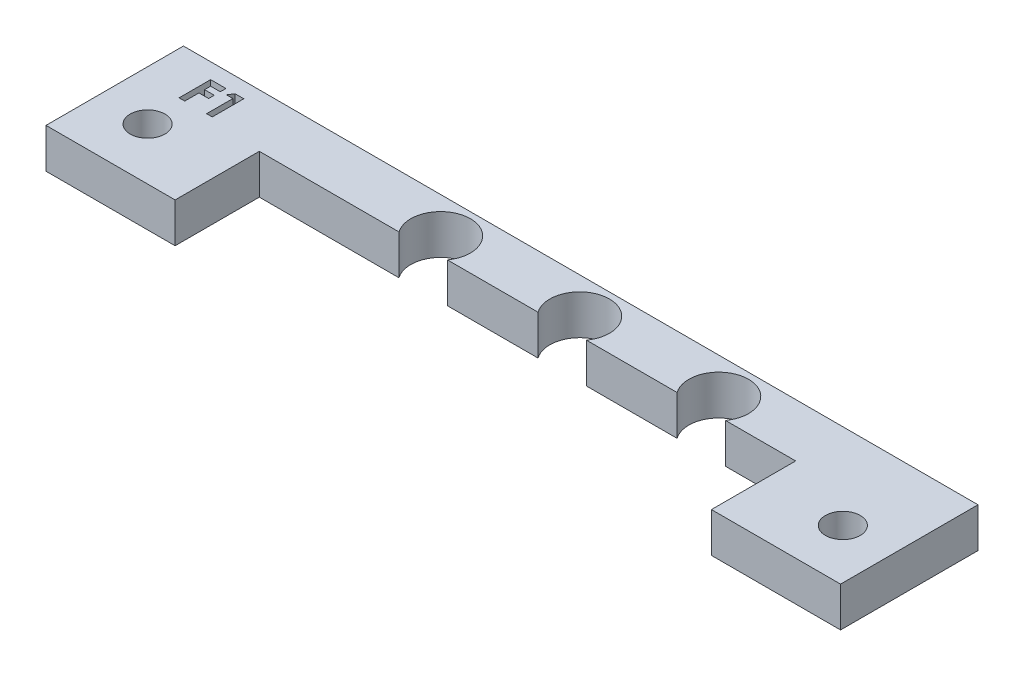
ISO-10303-21;
HEADER;
FILE_DESCRIPTION(('STEP AP214'),'2;1');
FILE_NAME('part.step','',(''),(''),'','','');
FILE_SCHEMA(('AUTOMOTIVE_DESIGN { 1 0 10303 214 1 1 1 1 }'));
ENDSEC;
DATA;
#1=APPLICATION_CONTEXT('core data for automotive mechanical design processes');
#2=APPLICATION_PROTOCOL_DEFINITION('international standard','automotive_design',2000,#1);
#3=PRODUCT_CONTEXT('',#1,'mechanical');
#4=PRODUCT('Part','Part','',(#3));
#5=PRODUCT_RELATED_PRODUCT_CATEGORY('part','',(#4));
#6=PRODUCT_DEFINITION_FORMATION('','',#4);
#7=PRODUCT_DEFINITION_CONTEXT('part definition',#1,'design');
#8=PRODUCT_DEFINITION('design','',#6,#7);
#9=PRODUCT_DEFINITION_SHAPE('','',#8);
#10=(LENGTH_UNIT() NAMED_UNIT(*) SI_UNIT(.MILLI.,.METRE.));
#11=(NAMED_UNIT(*) PLANE_ANGLE_UNIT() SI_UNIT($,.RADIAN.));
#12=(NAMED_UNIT(*) SI_UNIT($,.STERADIAN.) SOLID_ANGLE_UNIT());
#13=UNCERTAINTY_MEASURE_WITH_UNIT(LENGTH_MEASURE(1.E-05),#10,'distance_accuracy_value','');
#14=(GEOMETRIC_REPRESENTATION_CONTEXT(3) GLOBAL_UNCERTAINTY_ASSIGNED_CONTEXT((#13)) GLOBAL_UNIT_ASSIGNED_CONTEXT((#10,
#11,#12)) REPRESENTATION_CONTEXT('',''));
#15=CARTESIAN_POINT('',(0.,0.,0.));
#16=DIRECTION('',(0.,0.,1.));
#17=DIRECTION('',(1.,0.,0.));
#18=AXIS2_PLACEMENT_3D('',#15,#16,#17);
#19=CARTESIAN_POINT('',(0.,4.,0.));
#20=DIRECTION('',(0.,1.,0.));
#21=DIRECTION('',(0.,0.,1.));
#22=AXIS2_PLACEMENT_3D('',#19,#20,#21);
#23=PLANE('',#22);
#24=DIRECTION('',(0.,0.,1.));
#25=VECTOR('',#24,1.);
#26=CARTESIAN_POINT('',(60.3797761823175,4.,0.));
#27=LINE('',#26,#25);
#28=CARTESIAN_POINT('',(60.3797761823175,4.,4.97792171139692));
#29=VERTEX_POINT('',#28);
#30=CARTESIAN_POINT('',(60.3797761823175,4.,18.8163166195387));
#31=VERTEX_POINT('',#30);
#32=EDGE_CURVE('E339',#29,#31,#27,.T.);
#33=ORIENTED_EDGE('',*,*,#32,.F.);
#34=DIRECTION('',(1.,0.,0.));
#35=VECTOR('',#34,1.);
#36=CARTESIAN_POINT('',(0.,4.,4.97792171139692));
#37=LINE('',#36,#35);
#38=CARTESIAN_POINT('',(-19.6202238176825,4.,4.97792171139692));
#39=VERTEX_POINT('',#38);
#40=EDGE_CURVE('E343',#39,#29,#37,.T.);
#41=ORIENTED_EDGE('',*,*,#40,.F.);
#42=DIRECTION('',(0.,0.,-1.));
#43=VECTOR('',#42,1.);
#44=CARTESIAN_POINT('',(-19.6202238176825,4.,0.));
#45=LINE('',#44,#43);
#46=CARTESIAN_POINT('',(-19.6202238176825,4.,18.8163166195387));
#47=VERTEX_POINT('',#46);
#48=EDGE_CURVE('E348',#47,#39,#45,.T.);
#49=ORIENTED_EDGE('',*,*,#48,.F.);
#50=DIRECTION('',(1.,0.,0.));
#51=VECTOR('',#50,1.);
#52=CARTESIAN_POINT('',(0.,4.,18.8163166195387));
#53=LINE('',#52,#51);
#54=CARTESIAN_POINT('',(-6.62022381768248,4.,18.8163166195387));
#55=VERTEX_POINT('',#54);
#56=EDGE_CURVE('E352',#47,#55,#53,.T.);
#57=ORIENTED_EDGE('',*,*,#56,.T.);
#58=DIRECTION('',(0.,0.,1.));
#59=VECTOR('',#58,1.);
#60=CARTESIAN_POINT('',(-6.62022381768261,4.,0.));
#61=LINE('',#60,#59);
#62=CARTESIAN_POINT('',(-6.62022381768254,4.,10.3374425396581));
#63=VERTEX_POINT('',#62);
#64=EDGE_CURVE('E355',#63,#55,#61,.T.);
#65=ORIENTED_EDGE('',*,*,#64,.F.);
#66=DIRECTION('',(1.,0.,0.));
#67=VECTOR('',#66,1.);
#68=CARTESIAN_POINT('',(0.,4.,10.3374425396581));
#69=LINE('',#68,#67);
#70=CARTESIAN_POINT('',(7.44307774961269,4.,10.3374425396581));
#71=VERTEX_POINT('',#70);
#72=EDGE_CURVE('E359',#63,#71,#69,.T.);
#73=ORIENTED_EDGE('',*,*,#72,.T.);
#74=CARTESIAN_POINT('',(9.8797761823172,4.,8.58744232592798));
#75=DIRECTION('',(0.,1.,0.));
#76=DIRECTION('',(0.,0.,1.));
#77=AXIS2_PLACEMENT_3D('',#74,#75,#76);
#78=CIRCLE('',#77,3.);
#79=CARTESIAN_POINT('',(12.3164746150217,4.,10.3374425396581));
#80=VERTEX_POINT('',#79);
#81=EDGE_CURVE('E362',#80,#71,#78,.T.);
#82=ORIENTED_EDGE('',*,*,#81,.F.);
#83=DIRECTION('',(1.,0.,0.));
#84=VECTOR('',#83,1.);
#85=CARTESIAN_POINT('',(0.,4.,10.3374425396581));
#86=LINE('',#85,#84);
#87=CARTESIAN_POINT('',(21.4430777496133,4.,10.3374425396581));
#88=VERTEX_POINT('',#87);
#89=EDGE_CURVE('E366',#80,#88,#86,.T.);
#90=ORIENTED_EDGE('',*,*,#89,.T.);
#91=CARTESIAN_POINT('',(23.8797761823178,4.,8.58744232592798));
#92=DIRECTION('',(0.,1.,0.));
#93=DIRECTION('',(0.,0.,1.));
#94=AXIS2_PLACEMENT_3D('',#91,#92,#93);
#95=CIRCLE('',#94,3.);
#96=CARTESIAN_POINT('',(26.3164746150223,4.,10.3374425396581));
#97=VERTEX_POINT('',#96);
#98=EDGE_CURVE('E369',#97,#88,#95,.T.);
#99=ORIENTED_EDGE('',*,*,#98,.F.);
#100=DIRECTION('',(1.,0.,0.));
#101=VECTOR('',#100,1.);
#102=CARTESIAN_POINT('',(0.,4.,10.3374425396581));
#103=LINE('',#102,#101);
#104=CARTESIAN_POINT('',(35.4430777496131,4.,10.3374425396581));
#105=VERTEX_POINT('',#104);
#106=EDGE_CURVE('E373',#97,#105,#103,.T.);
#107=ORIENTED_EDGE('',*,*,#106,.T.);
#108=CARTESIAN_POINT('',(37.8797761823176,4.,8.58744232592797));
#109=DIRECTION('',(0.,1.,0.));
#110=DIRECTION('',(0.,0.,1.));
#111=AXIS2_PLACEMENT_3D('',#108,#109,#110);
#112=CIRCLE('',#111,3.);
#113=CARTESIAN_POINT('',(40.3164746150221,4.,10.3374425396581));
#114=VERTEX_POINT('',#113);
#115=EDGE_CURVE('E376',#114,#105,#112,.T.);
#116=ORIENTED_EDGE('',*,*,#115,.F.);
#117=DIRECTION('',(1.,0.,0.));
#118=VECTOR('',#117,1.);
#119=CARTESIAN_POINT('',(0.,4.,10.3374425396581));
#120=LINE('',#119,#118);
#121=CARTESIAN_POINT('',(47.3797761823176,4.,10.3374425396581));
#122=VERTEX_POINT('',#121);
#123=EDGE_CURVE('E380',#114,#122,#120,.T.);
#124=ORIENTED_EDGE('',*,*,#123,.T.);
#125=DIRECTION('',(0.,0.,-1.));
#126=VECTOR('',#125,1.);
#127=CARTESIAN_POINT('',(47.3797761823176,4.,0.));
#128=LINE('',#127,#126);
#129=CARTESIAN_POINT('',(47.3797761823175,4.,18.8163166195387));
#130=VERTEX_POINT('',#129);
#131=EDGE_CURVE('E383',#130,#122,#128,.T.);
#132=ORIENTED_EDGE('',*,*,#131,.F.);
#133=DIRECTION('',(1.,0.,0.));
#134=VECTOR('',#133,1.);
#135=CARTESIAN_POINT('',(0.,4.,18.8163166195387));
#136=LINE('',#135,#134);
#137=EDGE_CURVE('E387',#130,#31,#136,.T.);
#138=ORIENTED_EDGE('',*,*,#137,.T.);
#139=EDGE_LOOP('',(#33,#41,#49,#57,#65,#73,#82,#90,#99,#107,#116,#124,#132,#138));
#140=FACE_BOUND('',#139,.T.);
#141=CARTESIAN_POINT('',(-14.6202238176825,4.,13.5874425498356));
#142=DIRECTION('',(0.,1.,0.));
#143=DIRECTION('',(0.,0.,1.));
#144=AXIS2_PLACEMENT_3D('',#141,#142,#143);
#145=CIRCLE('',#144,1.75);
#146=CARTESIAN_POINT('',(-14.6202238176825,4.,15.3374425498356));
#147=VERTEX_POINT('',#146);
#148=EDGE_CURVE('E390',#147,#147,#145,.T.);
#149=ORIENTED_EDGE('',*,*,#148,.F.);
#150=EDGE_LOOP('',(#149));
#151=FACE_BOUND('',#150,.T.);
#152=CARTESIAN_POINT('',(55.3797761823175,4.,13.5874425498356));
#153=DIRECTION('',(0.,1.,0.));
#154=DIRECTION('',(0.,0.,1.));
#155=AXIS2_PLACEMENT_3D('',#152,#153,#154);
#156=CIRCLE('',#155,1.75);
#157=CARTESIAN_POINT('',(55.3797761823175,4.,15.3374425498356));
#158=VERTEX_POINT('',#157);
#159=EDGE_CURVE('E394',#158,#158,#156,.T.);
#160=ORIENTED_EDGE('',*,*,#159,.F.);
#161=EDGE_LOOP('',(#160));
#162=FACE_BOUND('',#161,.T.);
#163=DIRECTION('',(-1.,0.,0.));
#164=VECTOR('',#163,1.);
#165=CARTESIAN_POINT('',(-12.5528035614162,4.,7.06882575029212));
#166=LINE('',#165,#164);
#167=CARTESIAN_POINT('',(-12.5528035614162,4.,7.06882575029212));
#168=VERTEX_POINT('',#167);
#169=CARTESIAN_POINT('',(-13.2040856126982,4.,7.06882575029212));
#170=VERTEX_POINT('',#169);
#171=EDGE_CURVE('E299',#168,#170,#166,.T.);
#172=ORIENTED_EDGE('',*,*,#171,.T.);
#173=DIRECTION('',(0.54085977750342,0.,-0.841112775481951));
#174=VECTOR('',#173,1.);
#175=CARTESIAN_POINT('',(-13.2040856126982,4.,7.06882575029212));
#176=LINE('',#175,#174);
#177=CARTESIAN_POINT('',(-12.8638161816085,4.,6.53965908362545));
#178=VERTEX_POINT('',#177);
#179=EDGE_CURVE('E69',#170,#178,#176,.T.);
#180=ORIENTED_EDGE('',*,*,#179,.T.);
#181=DIRECTION('',(1.,0.,0.));
#182=VECTOR('',#181,1.);
#183=CARTESIAN_POINT('',(-12.8638161816085,4.,6.53965908362545));
#184=LINE('',#183,#182);
#185=CARTESIAN_POINT('',(-11.9829317665444,4.,6.53965908362545));
#186=VERTEX_POINT('',#185);
#187=EDGE_CURVE('E316',#178,#186,#184,.T.);
#188=ORIENTED_EDGE('',*,*,#187,.T.);
#189=DIRECTION('',(0.,0.,1.));
#190=VECTOR('',#189,1.);
#191=CARTESIAN_POINT('',(-11.9829317665444,4.,6.53965908362545));
#192=LINE('',#191,#190);
#193=CARTESIAN_POINT('',(-11.9829317665444,4.,9.71465908362545));
#194=VERTEX_POINT('',#193);
#195=EDGE_CURVE('E312',#186,#194,#192,.T.);
#196=ORIENTED_EDGE('',*,*,#195,.T.);
#197=DIRECTION('',(-1.,0.,0.));
#198=VECTOR('',#197,1.);
#199=CARTESIAN_POINT('',(-11.9829317665444,4.,9.71465908362545));
#200=LINE('',#199,#198);
#201=CARTESIAN_POINT('',(-12.5528035614162,4.,9.71465908362545));
#202=VERTEX_POINT('',#201);
#203=EDGE_CURVE('E308',#194,#202,#200,.T.);
#204=ORIENTED_EDGE('',*,*,#203,.T.);
#205=DIRECTION('',(0.,0.,-1.));
#206=VECTOR('',#205,1.);
#207=CARTESIAN_POINT('',(-12.5528035614162,4.,9.71465908362545));
#208=LINE('',#207,#206);
#209=EDGE_CURVE('E303',#202,#168,#208,.T.);
#210=ORIENTED_EDGE('',*,*,#209,.T.);
#211=EDGE_LOOP('',(#172,#180,#188,#196,#204,#210));
#212=FACE_BOUND('',#211,.T.);
#213=DIRECTION('',(-1.,0.,0.));
#214=VECTOR('',#213,1.);
#215=CARTESIAN_POINT('',(-14.7508804844931,4.,9.71465908362545));
#216=LINE('',#215,#214);
#217=CARTESIAN_POINT('',(-14.7508804844931,4.,9.71465908362545));
#218=VERTEX_POINT('',#217);
#219=CARTESIAN_POINT('',(-15.3207522793649,4.,9.71465908362545));
#220=VERTEX_POINT('',#219);
#221=EDGE_CURVE('E262',#218,#220,#216,.T.);
#222=ORIENTED_EDGE('',*,*,#221,.T.);
#223=DIRECTION('',(0.,0.,-1.));
#224=VECTOR('',#223,1.);
#225=CARTESIAN_POINT('',(-15.3207522793649,4.,9.71465908362545));
#226=LINE('',#225,#224);
#227=CARTESIAN_POINT('',(-15.3207522793649,4.,6.53965908362545));
#228=VERTEX_POINT('',#227);
#229=EDGE_CURVE('E61',#220,#228,#226,.T.);
#230=ORIENTED_EDGE('',*,*,#229,.T.);
#231=DIRECTION('',(1.,0.,0.));
#232=VECTOR('',#231,1.);
#233=CARTESIAN_POINT('',(-15.3207522793649,4.,6.53965908362545));
#234=LINE('',#233,#232);
#235=CARTESIAN_POINT('',(-13.77395740757,4.,6.53965908362545));
#236=VERTEX_POINT('',#235);
#237=EDGE_CURVE('E266',#228,#236,#234,.T.);
#238=ORIENTED_EDGE('',*,*,#237,.T.);
#239=DIRECTION('',(0.,0.,1.));
#240=VECTOR('',#239,1.);
#241=CARTESIAN_POINT('',(-13.77395740757,4.,6.53965908362545));
#242=LINE('',#241,#240);
#243=CARTESIAN_POINT('',(-13.77395740757,4.,7.10953087849725));
#244=VERTEX_POINT('',#243);
#245=EDGE_CURVE('E1118',#236,#244,#242,.T.);
#246=ORIENTED_EDGE('',*,*,#245,.T.);
#247=DIRECTION('',(-1.,0.,0.));
#248=VECTOR('',#247,1.);
#249=CARTESIAN_POINT('',(-13.77395740757,4.,7.10953087849725));
#250=LINE('',#249,#248);
#251=CARTESIAN_POINT('',(-14.7508804844931,4.,7.10953087849725));
#252=VERTEX_POINT('',#251);
#253=EDGE_CURVE('E1120',#244,#252,#250,.T.);
#254=ORIENTED_EDGE('',*,*,#253,.T.);
#255=DIRECTION('',(0.,0.,1.));
#256=VECTOR('',#255,1.);
#257=CARTESIAN_POINT('',(-14.7508804844931,4.,7.10953087849725));
#258=LINE('',#257,#256);
#259=CARTESIAN_POINT('',(-14.7508804844931,4.,7.72010780157417));
#260=VERTEX_POINT('',#259);
#261=EDGE_CURVE('E1125',#252,#260,#258,.T.);
#262=ORIENTED_EDGE('',*,*,#261,.T.);
#263=DIRECTION('',(1.,0.,0.));
#264=VECTOR('',#263,1.);
#265=CARTESIAN_POINT('',(-14.7508804844931,4.,7.72010780157417));
#266=LINE('',#265,#264);
#267=CARTESIAN_POINT('',(-13.77395740757,4.,7.72010780157417));
#268=VERTEX_POINT('',#267);
#269=EDGE_CURVE('E1135',#260,#268,#266,.T.);
#270=ORIENTED_EDGE('',*,*,#269,.T.);
#271=DIRECTION('',(0.,0.,1.));
#272=VECTOR('',#271,1.);
#273=CARTESIAN_POINT('',(-13.77395740757,4.,7.72010780157417));
#274=LINE('',#273,#272);
#275=CARTESIAN_POINT('',(-13.77395740757,4.,8.28997959644597));
#276=VERTEX_POINT('',#275);
#277=EDGE_CURVE('E1090',#268,#276,#274,.T.);
#278=ORIENTED_EDGE('',*,*,#277,.T.);
#279=DIRECTION('',(-1.,0.,0.));
#280=VECTOR('',#279,1.);
#281=CARTESIAN_POINT('',(-13.77395740757,4.,8.28997959644597));
#282=LINE('',#281,#280);
#283=CARTESIAN_POINT('',(-14.7508804844931,4.,8.28997959644597));
#284=VERTEX_POINT('',#283);
#285=EDGE_CURVE('E1085',#276,#284,#282,.T.);
#286=ORIENTED_EDGE('',*,*,#285,.T.);
#287=DIRECTION('',(0.,0.,1.));
#288=VECTOR('',#287,1.);
#289=CARTESIAN_POINT('',(-14.7508804844931,4.,8.28997959644597));
#290=LINE('',#289,#288);
#291=EDGE_CURVE('E1079',#284,#218,#290,.T.);
#292=ORIENTED_EDGE('',*,*,#291,.T.);
#293=EDGE_LOOP('',(#222,#230,#238,#246,#254,#262,#270,#278,#286,#292));
#294=FACE_BOUND('',#293,.T.);
#295=ADVANCED_FACE('F45',(#140,#151,#162,#212,#294),#23,.T.);
#296=CARTESIAN_POINT('',(60.3797761823175,4.,0.));
#297=DIRECTION('',(1.,0.,0.));
#298=DIRECTION('',(0.,0.,-1.));
#299=AXIS2_PLACEMENT_3D('',#296,#297,#298);
#300=PLANE('',#299);
#301=DIRECTION('',(0.,0.,1.));
#302=VECTOR('',#301,1.);
#303=CARTESIAN_POINT('',(60.3797761823175,0.,0.));
#304=LINE('',#303,#302);
#305=CARTESIAN_POINT('',(60.3797761823175,0.,4.97792171139692));
#306=VERTEX_POINT('',#305);
#307=CARTESIAN_POINT('',(60.3797761823175,0.,18.8163166195387));
#308=VERTEX_POINT('',#307);
#309=EDGE_CURVE('E268',#306,#308,#304,.T.);
#310=ORIENTED_EDGE('',*,*,#309,.F.);
#311=DIRECTION('',(0.,-1.,0.));
#312=VECTOR('',#311,1.);
#313=CARTESIAN_POINT('',(60.3797761823175,4.,4.97792171139692));
#314=LINE('',#313,#312);
#315=EDGE_CURVE('E11',#29,#306,#314,.T.);
#316=ORIENTED_EDGE('',*,*,#315,.F.);
#317=ORIENTED_EDGE('',*,*,#32,.T.);
#318=DIRECTION('',(0.,-1.,0.));
#319=VECTOR('',#318,1.);
#320=CARTESIAN_POINT('',(60.3797761823175,4.,18.8163166195387));
#321=LINE('',#320,#319);
#322=EDGE_CURVE('E397',#31,#308,#321,.T.);
#323=ORIENTED_EDGE('',*,*,#322,.T.);
#324=EDGE_LOOP('',(#310,#316,#317,#323));
#325=FACE_BOUND('',#324,.T.);
#326=ADVANCED_FACE('F47',(#325),#300,.T.);
#327=CARTESIAN_POINT('',(0.,4.,4.97792171139692));
#328=DIRECTION('',(0.,0.,-1.));
#329=DIRECTION('',(-1.,0.,0.));
#330=AXIS2_PLACEMENT_3D('',#327,#328,#329);
#331=PLANE('',#330);
#332=DIRECTION('',(1.,0.,0.));
#333=VECTOR('',#332,1.);
#334=CARTESIAN_POINT('',(0.,0.,4.97792171139692));
#335=LINE('',#334,#333);
#336=CARTESIAN_POINT('',(-19.6202238176825,0.,4.97792171139692));
#337=VERTEX_POINT('',#336);
#338=EDGE_CURVE('E274',#337,#306,#335,.T.);
#339=ORIENTED_EDGE('',*,*,#338,.F.);
#340=DIRECTION('',(0.,-1.,0.));
#341=VECTOR('',#340,1.);
#342=CARTESIAN_POINT('',(-19.6202238176825,4.,4.97792171139692));
#343=LINE('',#342,#341);
#344=EDGE_CURVE('E54',#39,#337,#343,.T.);
#345=ORIENTED_EDGE('',*,*,#344,.F.);
#346=ORIENTED_EDGE('',*,*,#40,.T.);
#347=ORIENTED_EDGE('',*,*,#315,.T.);
#348=EDGE_LOOP('',(#339,#345,#346,#347));
#349=FACE_BOUND('',#348,.T.);
#350=ADVANCED_FACE('F499',(#349),#331,.T.);
#351=CARTESIAN_POINT('',(-19.6202238176825,4.,0.));
#352=DIRECTION('',(-1.,0.,0.));
#353=DIRECTION('',(0.,0.,1.));
#354=AXIS2_PLACEMENT_3D('',#351,#352,#353);
#355=PLANE('',#354);
#356=DIRECTION('',(0.,0.,-1.));
#357=VECTOR('',#356,1.);
#358=CARTESIAN_POINT('',(-19.6202238176825,0.,0.));
#359=LINE('',#358,#357);
#360=CARTESIAN_POINT('',(-19.6202238176825,0.,18.8163166195387));
#361=VERTEX_POINT('',#360);
#362=EDGE_CURVE('E402',#361,#337,#359,.T.);
#363=ORIENTED_EDGE('',*,*,#362,.F.);
#364=DIRECTION('',(0.,-1.,0.));
#365=VECTOR('',#364,1.);
#366=CARTESIAN_POINT('',(-19.6202238176825,4.,18.8163166195387));
#367=LINE('',#366,#365);
#368=EDGE_CURVE('E489',#47,#361,#367,.T.);
#369=ORIENTED_EDGE('',*,*,#368,.F.);
#370=ORIENTED_EDGE('',*,*,#48,.T.);
#371=ORIENTED_EDGE('',*,*,#344,.T.);
#372=EDGE_LOOP('',(#363,#369,#370,#371));
#373=FACE_BOUND('',#372,.T.);
#374=ADVANCED_FACE('F495',(#373),#355,.T.);
#375=CARTESIAN_POINT('',(0.,4.,18.8163166195387));
#376=DIRECTION('',(0.,0.,-1.));
#377=DIRECTION('',(-1.,0.,0.));
#378=AXIS2_PLACEMENT_3D('',#375,#376,#377);
#379=PLANE('',#378);
#380=DIRECTION('',(1.,0.,0.));
#381=VECTOR('',#380,1.);
#382=CARTESIAN_POINT('',(0.,0.,18.8163166195387));
#383=LINE('',#382,#381);
#384=CARTESIAN_POINT('',(-6.62022381768248,0.,18.8163166195387));
#385=VERTEX_POINT('',#384);
#386=EDGE_CURVE('E406',#361,#385,#383,.T.);
#387=ORIENTED_EDGE('',*,*,#386,.T.);
#388=DIRECTION('',(0.,-1.,0.));
#389=VECTOR('',#388,1.);
#390=CARTESIAN_POINT('',(-6.62022381768248,4.,18.8163166195387));
#391=LINE('',#390,#389);
#392=EDGE_CURVE('E486',#55,#385,#391,.T.);
#393=ORIENTED_EDGE('',*,*,#392,.F.);
#394=ORIENTED_EDGE('',*,*,#56,.F.);
#395=ORIENTED_EDGE('',*,*,#368,.T.);
#396=EDGE_LOOP('',(#387,#393,#394,#395));
#397=FACE_BOUND('',#396,.T.);
#398=ADVANCED_FACE('F509',(#397),#379,.F.);
#399=CARTESIAN_POINT('',(-6.62022381768261,4.,0.));
#400=DIRECTION('',(1.,0.,0.));
#401=DIRECTION('',(0.,0.,-1.));
#402=AXIS2_PLACEMENT_3D('',#399,#400,#401);
#403=PLANE('',#402);
#404=DIRECTION('',(0.,0.,1.));
#405=VECTOR('',#404,1.);
#406=CARTESIAN_POINT('',(-6.62022381768261,0.,0.));
#407=LINE('',#406,#405);
#408=CARTESIAN_POINT('',(-6.62022381768254,0.,10.3374425396581));
#409=VERTEX_POINT('',#408);
#410=EDGE_CURVE('E410',#409,#385,#407,.T.);
#411=ORIENTED_EDGE('',*,*,#410,.F.);
#412=DIRECTION('',(0.,-1.,0.));
#413=VECTOR('',#412,1.);
#414=CARTESIAN_POINT('',(-6.62022381768254,4.,10.3374425396581));
#415=LINE('',#414,#413);
#416=EDGE_CURVE('E483',#63,#409,#415,.T.);
#417=ORIENTED_EDGE('',*,*,#416,.F.);
#418=ORIENTED_EDGE('',*,*,#64,.T.);
#419=ORIENTED_EDGE('',*,*,#392,.T.);
#420=EDGE_LOOP('',(#411,#417,#418,#419));
#421=FACE_BOUND('',#420,.T.);
#422=ADVANCED_FACE('F556',(#421),#403,.T.);
#423=CARTESIAN_POINT('',(0.,4.,10.3374425396581));
#424=DIRECTION('',(0.,0.,-1.));
#425=DIRECTION('',(-1.,0.,0.));
#426=AXIS2_PLACEMENT_3D('',#423,#424,#425);
#427=PLANE('',#426);
#428=DIRECTION('',(1.,0.,0.));
#429=VECTOR('',#428,1.);
#430=CARTESIAN_POINT('',(0.,0.,10.3374425396581));
#431=LINE('',#430,#429);
#432=CARTESIAN_POINT('',(7.44307774961269,0.,10.3374425396581));
#433=VERTEX_POINT('',#432);
#434=EDGE_CURVE('E414',#409,#433,#431,.T.);
#435=ORIENTED_EDGE('',*,*,#434,.T.);
#436=DIRECTION('',(0.,-1.,0.));
#437=VECTOR('',#436,1.);
#438=CARTESIAN_POINT('',(7.44307774961269,4.,10.3374425396581));
#439=LINE('',#438,#437);
#440=EDGE_CURVE('E480',#71,#433,#439,.T.);
#441=ORIENTED_EDGE('',*,*,#440,.F.);
#442=ORIENTED_EDGE('',*,*,#72,.F.);
#443=ORIENTED_EDGE('',*,*,#416,.T.);
#444=EDGE_LOOP('',(#435,#441,#442,#443));
#445=FACE_BOUND('',#444,.T.);
#446=ADVANCED_FACE('F554',(#445),#427,.F.);
#447=CARTESIAN_POINT('',(9.8797761823172,4.,8.58744232592798));
#448=DIRECTION('',(0.,-1.,0.));
#449=DIRECTION('',(0.,0.,-1.));
#450=AXIS2_PLACEMENT_3D('',#447,#448,#449);
#451=CYLINDRICAL_SURFACE('',#450,3.);
#452=CARTESIAN_POINT('',(9.8797761823172,0.,8.58744232592798));
#453=DIRECTION('',(0.,1.,0.));
#454=DIRECTION('',(0.,0.,1.));
#455=AXIS2_PLACEMENT_3D('',#452,#453,#454);
#456=CIRCLE('',#455,3.);
#457=CARTESIAN_POINT('',(12.3164746150217,0.,10.3374425396581));
#458=VERTEX_POINT('',#457);
#459=EDGE_CURVE('E418',#458,#433,#456,.T.);
#460=ORIENTED_EDGE('',*,*,#459,.F.);
#461=DIRECTION('',(0.,-1.,0.));
#462=VECTOR('',#461,1.);
#463=CARTESIAN_POINT('',(12.3164746150217,4.,10.3374425396581));
#464=LINE('',#463,#462);
#465=EDGE_CURVE('E477',#80,#458,#464,.T.);
#466=ORIENTED_EDGE('',*,*,#465,.F.);
#467=ORIENTED_EDGE('',*,*,#81,.T.);
#468=ORIENTED_EDGE('',*,*,#440,.T.);
#469=EDGE_LOOP('',(#460,#466,#467,#468));
#470=FACE_BOUND('',#469,.T.);
#471=ADVANCED_FACE('F549',(#470),#451,.F.);
#472=CARTESIAN_POINT('',(0.,4.,10.3374425396581));
#473=DIRECTION('',(0.,0.,-1.));
#474=DIRECTION('',(-1.,0.,0.));
#475=AXIS2_PLACEMENT_3D('',#472,#473,#474);
#476=PLANE('',#475);
#477=DIRECTION('',(1.,0.,0.));
#478=VECTOR('',#477,1.);
#479=CARTESIAN_POINT('',(0.,0.,10.3374425396581));
#480=LINE('',#479,#478);
#481=CARTESIAN_POINT('',(21.4430777496133,0.,10.3374425396581));
#482=VERTEX_POINT('',#481);
#483=EDGE_CURVE('E422',#458,#482,#480,.T.);
#484=ORIENTED_EDGE('',*,*,#483,.T.);
#485=DIRECTION('',(0.,-1.,0.));
#486=VECTOR('',#485,1.);
#487=CARTESIAN_POINT('',(21.4430777496133,4.,10.3374425396581));
#488=LINE('',#487,#486);
#489=EDGE_CURVE('E474',#88,#482,#488,.T.);
#490=ORIENTED_EDGE('',*,*,#489,.F.);
#491=ORIENTED_EDGE('',*,*,#89,.F.);
#492=ORIENTED_EDGE('',*,*,#465,.T.);
#493=EDGE_LOOP('',(#484,#490,#491,#492));
#494=FACE_BOUND('',#493,.T.);
#495=ADVANCED_FACE('F546',(#494),#476,.F.);
#496=CARTESIAN_POINT('',(23.8797761823178,4.,8.58744232592798));
#497=DIRECTION('',(0.,-1.,0.));
#498=DIRECTION('',(0.,0.,-1.));
#499=AXIS2_PLACEMENT_3D('',#496,#497,#498);
#500=CYLINDRICAL_SURFACE('',#499,3.);
#501=CARTESIAN_POINT('',(23.8797761823178,0.,8.58744232592798));
#502=DIRECTION('',(0.,1.,0.));
#503=DIRECTION('',(0.,0.,1.));
#504=AXIS2_PLACEMENT_3D('',#501,#502,#503);
#505=CIRCLE('',#504,3.);
#506=CARTESIAN_POINT('',(26.3164746150223,0.,10.3374425396581));
#507=VERTEX_POINT('',#506);
#508=EDGE_CURVE('E426',#507,#482,#505,.T.);
#509=ORIENTED_EDGE('',*,*,#508,.F.);
#510=DIRECTION('',(0.,-1.,0.));
#511=VECTOR('',#510,1.);
#512=CARTESIAN_POINT('',(26.3164746150223,4.,10.3374425396581));
#513=LINE('',#512,#511);
#514=EDGE_CURVE('E471',#97,#507,#513,.T.);
#515=ORIENTED_EDGE('',*,*,#514,.F.);
#516=ORIENTED_EDGE('',*,*,#98,.T.);
#517=ORIENTED_EDGE('',*,*,#489,.T.);
#518=EDGE_LOOP('',(#509,#515,#516,#517));
#519=FACE_BOUND('',#518,.T.);
#520=ADVANCED_FACE('F541',(#519),#500,.F.);
#521=CARTESIAN_POINT('',(0.,4.,10.3374425396581));
#522=DIRECTION('',(0.,0.,-1.));
#523=DIRECTION('',(-1.,0.,0.));
#524=AXIS2_PLACEMENT_3D('',#521,#522,#523);
#525=PLANE('',#524);
#526=DIRECTION('',(1.,0.,0.));
#527=VECTOR('',#526,1.);
#528=CARTESIAN_POINT('',(0.,0.,10.3374425396581));
#529=LINE('',#528,#527);
#530=CARTESIAN_POINT('',(35.4430777496131,0.,10.3374425396581));
#531=VERTEX_POINT('',#530);
#532=EDGE_CURVE('E430',#507,#531,#529,.T.);
#533=ORIENTED_EDGE('',*,*,#532,.T.);
#534=DIRECTION('',(0.,-1.,0.));
#535=VECTOR('',#534,1.);
#536=CARTESIAN_POINT('',(35.4430777496131,4.,10.3374425396581));
#537=LINE('',#536,#535);
#538=EDGE_CURVE('E468',#105,#531,#537,.T.);
#539=ORIENTED_EDGE('',*,*,#538,.F.);
#540=ORIENTED_EDGE('',*,*,#106,.F.);
#541=ORIENTED_EDGE('',*,*,#514,.T.);
#542=EDGE_LOOP('',(#533,#539,#540,#541));
#543=FACE_BOUND('',#542,.T.);
#544=ADVANCED_FACE('F537',(#543),#525,.F.);
#545=CARTESIAN_POINT('',(37.8797761823176,4.,8.58744232592797));
#546=DIRECTION('',(0.,-1.,0.));
#547=DIRECTION('',(0.,0.,-1.));
#548=AXIS2_PLACEMENT_3D('',#545,#546,#547);
#549=CYLINDRICAL_SURFACE('',#548,3.);
#550=CARTESIAN_POINT('',(37.8797761823176,0.,8.58744232592797));
#551=DIRECTION('',(0.,1.,0.));
#552=DIRECTION('',(0.,0.,1.));
#553=AXIS2_PLACEMENT_3D('',#550,#551,#552);
#554=CIRCLE('',#553,3.);
#555=CARTESIAN_POINT('',(40.3164746150221,0.,10.3374425396581));
#556=VERTEX_POINT('',#555);
#557=EDGE_CURVE('E434',#556,#531,#554,.T.);
#558=ORIENTED_EDGE('',*,*,#557,.F.);
#559=DIRECTION('',(0.,-1.,0.));
#560=VECTOR('',#559,1.);
#561=CARTESIAN_POINT('',(40.3164746150221,4.,10.3374425396581));
#562=LINE('',#561,#560);
#563=EDGE_CURVE('E465',#114,#556,#562,.T.);
#564=ORIENTED_EDGE('',*,*,#563,.F.);
#565=ORIENTED_EDGE('',*,*,#115,.T.);
#566=ORIENTED_EDGE('',*,*,#538,.T.);
#567=EDGE_LOOP('',(#558,#564,#565,#566));
#568=FACE_BOUND('',#567,.T.);
#569=ADVANCED_FACE('F532',(#568),#549,.F.);
#570=CARTESIAN_POINT('',(0.,4.,10.3374425396581));
#571=DIRECTION('',(0.,0.,-1.));
#572=DIRECTION('',(-1.,0.,0.));
#573=AXIS2_PLACEMENT_3D('',#570,#571,#572);
#574=PLANE('',#573);
#575=DIRECTION('',(1.,0.,0.));
#576=VECTOR('',#575,1.);
#577=CARTESIAN_POINT('',(0.,0.,10.3374425396581));
#578=LINE('',#577,#576);
#579=CARTESIAN_POINT('',(47.3797761823176,0.,10.3374425396581));
#580=VERTEX_POINT('',#579);
#581=EDGE_CURVE('E438',#556,#580,#578,.T.);
#582=ORIENTED_EDGE('',*,*,#581,.T.);
#583=DIRECTION('',(0.,-1.,0.));
#584=VECTOR('',#583,1.);
#585=CARTESIAN_POINT('',(47.3797761823176,4.,10.3374425396581));
#586=LINE('',#585,#584);
#587=EDGE_CURVE('E462',#122,#580,#586,.T.);
#588=ORIENTED_EDGE('',*,*,#587,.F.);
#589=ORIENTED_EDGE('',*,*,#123,.F.);
#590=ORIENTED_EDGE('',*,*,#563,.T.);
#591=EDGE_LOOP('',(#582,#588,#589,#590));
#592=FACE_BOUND('',#591,.T.);
#593=ADVANCED_FACE('F528',(#592),#574,.F.);
#594=CARTESIAN_POINT('',(47.3797761823176,4.,0.));
#595=DIRECTION('',(-1.,0.,0.));
#596=DIRECTION('',(0.,0.,1.));
#597=AXIS2_PLACEMENT_3D('',#594,#595,#596);
#598=PLANE('',#597);
#599=DIRECTION('',(0.,0.,-1.));
#600=VECTOR('',#599,1.);
#601=CARTESIAN_POINT('',(47.3797761823176,0.,0.));
#602=LINE('',#601,#600);
#603=CARTESIAN_POINT('',(47.3797761823175,0.,18.8163166195387));
#604=VERTEX_POINT('',#603);
#605=EDGE_CURVE('E442',#604,#580,#602,.T.);
#606=ORIENTED_EDGE('',*,*,#605,.F.);
#607=DIRECTION('',(0.,-1.,0.));
#608=VECTOR('',#607,1.);
#609=CARTESIAN_POINT('',(47.3797761823175,4.,18.8163166195387));
#610=LINE('',#609,#608);
#611=EDGE_CURVE('E459',#130,#604,#610,.T.);
#612=ORIENTED_EDGE('',*,*,#611,.F.);
#613=ORIENTED_EDGE('',*,*,#131,.T.);
#614=ORIENTED_EDGE('',*,*,#587,.T.);
#615=EDGE_LOOP('',(#606,#612,#613,#614));
#616=FACE_BOUND('',#615,.T.);
#617=ADVANCED_FACE('F524',(#616),#598,.T.);
#618=CARTESIAN_POINT('',(-14.6202238176825,4.,13.5874425498356));
#619=DIRECTION('',(0.,-1.,0.));
#620=DIRECTION('',(0.,0.,-1.));
#621=AXIS2_PLACEMENT_3D('',#618,#619,#620);
#622=CYLINDRICAL_SURFACE('',#621,1.75);
#623=ORIENTED_EDGE('',*,*,#148,.T.);
#624=EDGE_LOOP('',(#623));
#625=FACE_BOUND('',#624,.T.);
#626=CARTESIAN_POINT('',(-14.6202238176825,0.,13.5874425498356));
#627=DIRECTION('',(0.,1.,0.));
#628=DIRECTION('',(0.,0.,1.));
#629=AXIS2_PLACEMENT_3D('',#626,#627,#628);
#630=CIRCLE('',#629,1.75);
#631=CARTESIAN_POINT('',(-14.6202238176825,0.,15.3374425498356));
#632=VERTEX_POINT('',#631);
#633=EDGE_CURVE('E450',#632,#632,#630,.T.);
#634=ORIENTED_EDGE('',*,*,#633,.F.);
#635=EDGE_LOOP('',(#634));
#636=FACE_BOUND('',#635,.T.);
#637=ADVANCED_FACE('F582',(#625,#636),#622,.F.);
#638=CARTESIAN_POINT('',(0.,4.,18.8163166195387));
#639=DIRECTION('',(0.,0.,-1.));
#640=DIRECTION('',(-1.,0.,0.));
#641=AXIS2_PLACEMENT_3D('',#638,#639,#640);
#642=PLANE('',#641);
#643=DIRECTION('',(1.,0.,0.));
#644=VECTOR('',#643,1.);
#645=CARTESIAN_POINT('',(0.,0.,18.8163166195387));
#646=LINE('',#645,#644);
#647=EDGE_CURVE('E446',#604,#308,#646,.T.);
#648=ORIENTED_EDGE('',*,*,#647,.T.);
#649=ORIENTED_EDGE('',*,*,#322,.F.);
#650=ORIENTED_EDGE('',*,*,#137,.F.);
#651=ORIENTED_EDGE('',*,*,#611,.T.);
#652=EDGE_LOOP('',(#648,#649,#650,#651));
#653=FACE_BOUND('',#652,.T.);
#654=ADVANCED_FACE('F580',(#653),#642,.F.);
#655=CARTESIAN_POINT('',(55.3797761823175,4.,13.5874425498356));
#656=DIRECTION('',(0.,-1.,0.));
#657=DIRECTION('',(0.,0.,-1.));
#658=AXIS2_PLACEMENT_3D('',#655,#656,#657);
#659=CYLINDRICAL_SURFACE('',#658,1.75);
#660=ORIENTED_EDGE('',*,*,#159,.T.);
#661=EDGE_LOOP('',(#660));
#662=FACE_BOUND('',#661,.T.);
#663=CARTESIAN_POINT('',(55.3797761823175,0.,13.5874425498356));
#664=DIRECTION('',(0.,1.,0.));
#665=DIRECTION('',(0.,0.,1.));
#666=AXIS2_PLACEMENT_3D('',#663,#664,#665);
#667=CIRCLE('',#666,1.75);
#668=CARTESIAN_POINT('',(55.3797761823175,0.,15.3374425498356));
#669=VERTEX_POINT('',#668);
#670=EDGE_CURVE('E344',#669,#669,#667,.T.);
#671=ORIENTED_EDGE('',*,*,#670,.F.);
#672=EDGE_LOOP('',(#671));
#673=FACE_BOUND('',#672,.T.);
#674=ADVANCED_FACE('F577',(#662,#673),#659,.F.);
#675=CARTESIAN_POINT('',(0.,0.,0.));
#676=DIRECTION('',(0.,1.,0.));
#677=DIRECTION('',(0.,0.,1.));
#678=AXIS2_PLACEMENT_3D('',#675,#676,#677);
#679=PLANE('',#678);
#680=ORIENTED_EDGE('',*,*,#309,.T.);
#681=ORIENTED_EDGE('',*,*,#647,.F.);
#682=ORIENTED_EDGE('',*,*,#605,.T.);
#683=ORIENTED_EDGE('',*,*,#581,.F.);
#684=ORIENTED_EDGE('',*,*,#557,.T.);
#685=ORIENTED_EDGE('',*,*,#532,.F.);
#686=ORIENTED_EDGE('',*,*,#508,.T.);
#687=ORIENTED_EDGE('',*,*,#483,.F.);
#688=ORIENTED_EDGE('',*,*,#459,.T.);
#689=ORIENTED_EDGE('',*,*,#434,.F.);
#690=ORIENTED_EDGE('',*,*,#410,.T.);
#691=ORIENTED_EDGE('',*,*,#386,.F.);
#692=ORIENTED_EDGE('',*,*,#362,.T.);
#693=ORIENTED_EDGE('',*,*,#338,.T.);
#694=EDGE_LOOP('',(#680,#681,#682,#683,#684,#685,#686,#687,#688,#689,#690,#691,#692,#693));
#695=FACE_BOUND('',#694,.T.);
#696=ORIENTED_EDGE('',*,*,#633,.T.);
#697=EDGE_LOOP('',(#696));
#698=FACE_BOUND('',#697,.T.);
#699=ORIENTED_EDGE('',*,*,#670,.T.);
#700=EDGE_LOOP('',(#699));
#701=FACE_BOUND('',#700,.T.);
#702=ADVANCED_FACE('F503',(#695,#698,#701),#679,.F.);
#703=CARTESIAN_POINT('',(-13.2040856126982,3.,7.06882575029212));
#704=DIRECTION('',(0.841112775481951,0.,0.54085977750342));
#705=DIRECTION('',(0.54085977750342,0.,-0.841112775481951));
#706=AXIS2_PLACEMENT_3D('',#703,#704,#705);
#707=PLANE('',#706);
#708=ORIENTED_EDGE('',*,*,#179,.F.);
#709=DIRECTION('',(0.,1.,0.));
#710=VECTOR('',#709,1.);
#711=CARTESIAN_POINT('',(-13.2040856126982,3.,7.06882575029212));
#712=LINE('',#711,#710);
#713=CARTESIAN_POINT('',(-13.2040856126982,3.,7.06882575029212));
#714=VERTEX_POINT('',#713);
#715=EDGE_CURVE('E295',#714,#170,#712,.T.);
#716=ORIENTED_EDGE('',*,*,#715,.F.);
#717=DIRECTION('',(0.54085977750342,0.,-0.841112775481951));
#718=VECTOR('',#717,1.);
#719=CARTESIAN_POINT('',(-13.2040856126982,3.,7.06882575029212));
#720=LINE('',#719,#718);
#721=CARTESIAN_POINT('',(-12.8638161816085,3.,6.53965908362545));
#722=VERTEX_POINT('',#721);
#723=EDGE_CURVE('E304',#714,#722,#720,.T.);
#724=ORIENTED_EDGE('',*,*,#723,.T.);
#725=DIRECTION('',(0.,1.,0.));
#726=VECTOR('',#725,1.);
#727=CARTESIAN_POINT('',(-12.8638161816085,3.,6.53965908362545));
#728=LINE('',#727,#726);
#729=EDGE_CURVE('E280',#722,#178,#728,.T.);
#730=ORIENTED_EDGE('',*,*,#729,.T.);
#731=EDGE_LOOP('',(#708,#716,#724,#730));
#732=FACE_BOUND('',#731,.T.);
#733=ADVANCED_FACE('F576',(#732),#707,.T.);
#734=CARTESIAN_POINT('',(-12.8638161816085,3.,6.53965908362545));
#735=DIRECTION('',(0.,0.,1.));
#736=DIRECTION('',(1.,0.,0.));
#737=AXIS2_PLACEMENT_3D('',#734,#735,#736);
#738=PLANE('',#737);
#739=ORIENTED_EDGE('',*,*,#187,.F.);
#740=ORIENTED_EDGE('',*,*,#729,.F.);
#741=DIRECTION('',(1.,0.,0.));
#742=VECTOR('',#741,1.);
#743=CARTESIAN_POINT('',(-12.8638161816085,3.,6.53965908362545));
#744=LINE('',#743,#742);
#745=CARTESIAN_POINT('',(-11.9829317665444,3.,6.53965908362545));
#746=VERTEX_POINT('',#745);
#747=EDGE_CURVE('E333',#722,#746,#744,.T.);
#748=ORIENTED_EDGE('',*,*,#747,.T.);
#749=DIRECTION('',(0.,1.,0.));
#750=VECTOR('',#749,1.);
#751=CARTESIAN_POINT('',(-11.9829317665444,3.,6.53965908362545));
#752=LINE('',#751,#750);
#753=EDGE_CURVE('E283',#746,#186,#752,.T.);
#754=ORIENTED_EDGE('',*,*,#753,.T.);
#755=EDGE_LOOP('',(#739,#740,#748,#754));
#756=FACE_BOUND('',#755,.T.);
#757=ADVANCED_FACE('F651',(#756),#738,.T.);
#758=CARTESIAN_POINT('',(-11.9829317665444,3.,6.53965908362545));
#759=DIRECTION('',(-1.,0.,0.));
#760=DIRECTION('',(0.,0.,1.));
#761=AXIS2_PLACEMENT_3D('',#758,#759,#760);
#762=PLANE('',#761);
#763=ORIENTED_EDGE('',*,*,#195,.F.);
#764=ORIENTED_EDGE('',*,*,#753,.F.);
#765=DIRECTION('',(0.,0.,1.));
#766=VECTOR('',#765,1.);
#767=CARTESIAN_POINT('',(-11.9829317665444,3.,6.53965908362545));
#768=LINE('',#767,#766);
#769=CARTESIAN_POINT('',(-11.9829317665444,3.,9.71465908362545));
#770=VERTEX_POINT('',#769);
#771=EDGE_CURVE('E330',#746,#770,#768,.T.);
#772=ORIENTED_EDGE('',*,*,#771,.T.);
#773=DIRECTION('',(0.,1.,0.));
#774=VECTOR('',#773,1.);
#775=CARTESIAN_POINT('',(-11.9829317665444,3.,9.71465908362545));
#776=LINE('',#775,#774);
#777=EDGE_CURVE('E286',#770,#194,#776,.T.);
#778=ORIENTED_EDGE('',*,*,#777,.T.);
#779=EDGE_LOOP('',(#763,#764,#772,#778));
#780=FACE_BOUND('',#779,.T.);
#781=ADVANCED_FACE('F658',(#780),#762,.T.);
#782=CARTESIAN_POINT('',(-11.9829317665444,3.,9.71465908362545));
#783=DIRECTION('',(0.,0.,-1.));
#784=DIRECTION('',(-1.,0.,0.));
#785=AXIS2_PLACEMENT_3D('',#782,#783,#784);
#786=PLANE('',#785);
#787=ORIENTED_EDGE('',*,*,#203,.F.);
#788=ORIENTED_EDGE('',*,*,#777,.F.);
#789=DIRECTION('',(-1.,0.,0.));
#790=VECTOR('',#789,1.);
#791=CARTESIAN_POINT('',(-11.9829317665444,3.,9.71465908362545));
#792=LINE('',#791,#790);
#793=CARTESIAN_POINT('',(-12.5528035614162,3.,9.71465908362545));
#794=VERTEX_POINT('',#793);
#795=EDGE_CURVE('E327',#770,#794,#792,.T.);
#796=ORIENTED_EDGE('',*,*,#795,.T.);
#797=DIRECTION('',(0.,1.,0.));
#798=VECTOR('',#797,1.);
#799=CARTESIAN_POINT('',(-12.5528035614162,3.,9.71465908362545));
#800=LINE('',#799,#798);
#801=EDGE_CURVE('E289',#794,#202,#800,.T.);
#802=ORIENTED_EDGE('',*,*,#801,.T.);
#803=EDGE_LOOP('',(#787,#788,#796,#802));
#804=FACE_BOUND('',#803,.T.);
#805=ADVANCED_FACE('F666',(#804),#786,.T.);
#806=CARTESIAN_POINT('',(-12.5528035614162,3.,9.71465908362545));
#807=DIRECTION('',(1.,0.,0.));
#808=DIRECTION('',(0.,0.,-1.));
#809=AXIS2_PLACEMENT_3D('',#806,#807,#808);
#810=PLANE('',#809);
#811=ORIENTED_EDGE('',*,*,#209,.F.);
#812=ORIENTED_EDGE('',*,*,#801,.F.);
#813=DIRECTION('',(0.,0.,-1.));
#814=VECTOR('',#813,1.);
#815=CARTESIAN_POINT('',(-12.5528035614162,3.,9.71465908362545));
#816=LINE('',#815,#814);
#817=CARTESIAN_POINT('',(-12.5528035614162,3.,7.06882575029212));
#818=VERTEX_POINT('',#817);
#819=EDGE_CURVE('E324',#794,#818,#816,.T.);
#820=ORIENTED_EDGE('',*,*,#819,.T.);
#821=DIRECTION('',(0.,1.,0.));
#822=VECTOR('',#821,1.);
#823=CARTESIAN_POINT('',(-12.5528035614162,3.,7.06882575029212));
#824=LINE('',#823,#822);
#825=EDGE_CURVE('E292',#818,#168,#824,.T.);
#826=ORIENTED_EDGE('',*,*,#825,.T.);
#827=EDGE_LOOP('',(#811,#812,#820,#826));
#828=FACE_BOUND('',#827,.T.);
#829=ADVANCED_FACE('F674',(#828),#810,.T.);
#830=CARTESIAN_POINT('',(-12.5528035614162,3.,7.06882575029212));
#831=DIRECTION('',(0.,0.,-1.));
#832=DIRECTION('',(-1.,0.,0.));
#833=AXIS2_PLACEMENT_3D('',#830,#831,#832);
#834=PLANE('',#833);
#835=ORIENTED_EDGE('',*,*,#171,.F.);
#836=ORIENTED_EDGE('',*,*,#825,.F.);
#837=DIRECTION('',(-1.,0.,0.));
#838=VECTOR('',#837,1.);
#839=CARTESIAN_POINT('',(-12.5528035614162,3.,7.06882575029212));
#840=LINE('',#839,#838);
#841=EDGE_CURVE('E298',#818,#714,#840,.T.);
#842=ORIENTED_EDGE('',*,*,#841,.T.);
#843=ORIENTED_EDGE('',*,*,#715,.T.);
#844=EDGE_LOOP('',(#835,#836,#842,#843));
#845=FACE_BOUND('',#844,.T.);
#846=ADVANCED_FACE('F682',(#845),#834,.T.);
#847=CARTESIAN_POINT('',(0.,3.,0.));
#848=DIRECTION('',(0.,-1.,0.));
#849=DIRECTION('',(0.,0.,-1.));
#850=AXIS2_PLACEMENT_3D('',#847,#848,#849);
#851=PLANE('',#850);
#852=ORIENTED_EDGE('',*,*,#723,.F.);
#853=ORIENTED_EDGE('',*,*,#841,.F.);
#854=ORIENTED_EDGE('',*,*,#819,.F.);
#855=ORIENTED_EDGE('',*,*,#795,.F.);
#856=ORIENTED_EDGE('',*,*,#771,.F.);
#857=ORIENTED_EDGE('',*,*,#747,.F.);
#858=EDGE_LOOP('',(#852,#853,#854,#855,#856,#857));
#859=FACE_BOUND('',#858,.T.);
#860=ADVANCED_FACE('F572',(#859),#851,.F.);
#861=CARTESIAN_POINT('',(-15.3207522793649,3.,9.71465908362545));
#862=DIRECTION('',(1.,0.,0.));
#863=DIRECTION('',(0.,0.,-1.));
#864=AXIS2_PLACEMENT_3D('',#861,#862,#863);
#865=PLANE('',#864);
#866=ORIENTED_EDGE('',*,*,#229,.F.);
#867=DIRECTION('',(0.,1.,0.));
#868=VECTOR('',#867,1.);
#869=CARTESIAN_POINT('',(-15.3207522793649,3.,9.71465908362545));
#870=LINE('',#869,#868);
#871=CARTESIAN_POINT('',(-15.3207522793649,3.,9.71465908362545));
#872=VERTEX_POINT('',#871);
#873=EDGE_CURVE('E260',#872,#220,#870,.T.);
#874=ORIENTED_EDGE('',*,*,#873,.F.);
#875=DIRECTION('',(0.,0.,-1.));
#876=VECTOR('',#875,1.);
#877=CARTESIAN_POINT('',(-15.3207522793649,3.,9.71465908362545));
#878=LINE('',#877,#876);
#879=CARTESIAN_POINT('',(-15.3207522793649,3.,6.53965908362545));
#880=VERTEX_POINT('',#879);
#881=EDGE_CURVE('E250',#872,#880,#878,.T.);
#882=ORIENTED_EDGE('',*,*,#881,.T.);
#883=DIRECTION('',(0.,1.,0.));
#884=VECTOR('',#883,1.);
#885=CARTESIAN_POINT('',(-15.3207522793649,3.,6.53965908362545));
#886=LINE('',#885,#884);
#887=EDGE_CURVE('E259',#880,#228,#886,.T.);
#888=ORIENTED_EDGE('',*,*,#887,.T.);
#889=EDGE_LOOP('',(#866,#874,#882,#888));
#890=FACE_BOUND('',#889,.T.);
#891=ADVANCED_FACE('F258',(#890),#865,.T.);
#892=CARTESIAN_POINT('',(-15.3207522793649,3.,6.53965908362545));
#893=DIRECTION('',(0.,0.,1.));
#894=DIRECTION('',(1.,0.,0.));
#895=AXIS2_PLACEMENT_3D('',#892,#893,#894);
#896=PLANE('',#895);
#897=ORIENTED_EDGE('',*,*,#237,.F.);
#898=ORIENTED_EDGE('',*,*,#887,.F.);
#899=DIRECTION('',(1.,0.,0.));
#900=VECTOR('',#899,1.);
#901=CARTESIAN_POINT('',(-15.3207522793649,3.,6.53965908362545));
#902=LINE('',#901,#900);
#903=CARTESIAN_POINT('',(-13.77395740757,3.,6.53965908362545));
#904=VERTEX_POINT('',#903);
#905=EDGE_CURVE('E246',#880,#904,#902,.T.);
#906=ORIENTED_EDGE('',*,*,#905,.T.);
#907=DIRECTION('',(0.,1.,0.));
#908=VECTOR('',#907,1.);
#909=CARTESIAN_POINT('',(-13.77395740757,3.,6.53965908362545));
#910=LINE('',#909,#908);
#911=EDGE_CURVE('E269',#904,#236,#910,.T.);
#912=ORIENTED_EDGE('',*,*,#911,.T.);
#913=EDGE_LOOP('',(#897,#898,#906,#912));
#914=FACE_BOUND('',#913,.T.);
#915=ADVANCED_FACE('F264',(#914),#896,.T.);
#916=CARTESIAN_POINT('',(-13.77395740757,3.,6.53965908362545));
#917=DIRECTION('',(-1.,0.,0.));
#918=DIRECTION('',(0.,0.,1.));
#919=AXIS2_PLACEMENT_3D('',#916,#917,#918);
#920=PLANE('',#919);
#921=ORIENTED_EDGE('',*,*,#245,.F.);
#922=ORIENTED_EDGE('',*,*,#911,.F.);
#923=DIRECTION('',(0.,0.,1.));
#924=VECTOR('',#923,1.);
#925=CARTESIAN_POINT('',(-13.77395740757,3.,6.53965908362545));
#926=LINE('',#925,#924);
#927=CARTESIAN_POINT('',(-13.77395740757,3.,7.10953087849725));
#928=VERTEX_POINT('',#927);
#929=EDGE_CURVE('E252',#904,#928,#926,.T.);
#930=ORIENTED_EDGE('',*,*,#929,.T.);
#931=DIRECTION('',(0.,1.,0.));
#932=VECTOR('',#931,1.);
#933=CARTESIAN_POINT('',(-13.77395740757,3.,7.10953087849725));
#934=LINE('',#933,#932);
#935=EDGE_CURVE('E276',#928,#244,#934,.T.);
#936=ORIENTED_EDGE('',*,*,#935,.T.);
#937=EDGE_LOOP('',(#921,#922,#930,#936));
#938=FACE_BOUND('',#937,.T.);
#939=ADVANCED_FACE('F708',(#938),#920,.T.);
#940=CARTESIAN_POINT('',(-13.77395740757,3.,7.10953087849725));
#941=DIRECTION('',(0.,0.,-1.));
#942=DIRECTION('',(-1.,0.,0.));
#943=AXIS2_PLACEMENT_3D('',#940,#941,#942);
#944=PLANE('',#943);
#945=ORIENTED_EDGE('',*,*,#253,.F.);
#946=ORIENTED_EDGE('',*,*,#935,.F.);
#947=DIRECTION('',(-1.,0.,0.));
#948=VECTOR('',#947,1.);
#949=CARTESIAN_POINT('',(-13.77395740757,3.,7.10953087849725));
#950=LINE('',#949,#948);
#951=CARTESIAN_POINT('',(-14.7508804844931,3.,7.10953087849725));
#952=VERTEX_POINT('',#951);
#953=EDGE_CURVE('E1165',#928,#952,#950,.T.);
#954=ORIENTED_EDGE('',*,*,#953,.T.);
#955=DIRECTION('',(0.,1.,0.));
#956=VECTOR('',#955,1.);
#957=CARTESIAN_POINT('',(-14.7508804844931,3.,7.10953087849725));
#958=LINE('',#957,#956);
#959=EDGE_CURVE('E1111',#952,#252,#958,.T.);
#960=ORIENTED_EDGE('',*,*,#959,.T.);
#961=EDGE_LOOP('',(#945,#946,#954,#960));
#962=FACE_BOUND('',#961,.T.);
#963=ADVANCED_FACE('F715',(#962),#944,.T.);
#964=CARTESIAN_POINT('',(-14.7508804844931,3.,7.10953087849725));
#965=DIRECTION('',(-1.,0.,0.));
#966=DIRECTION('',(0.,0.,1.));
#967=AXIS2_PLACEMENT_3D('',#964,#965,#966);
#968=PLANE('',#967);
#969=ORIENTED_EDGE('',*,*,#261,.F.);
#970=ORIENTED_EDGE('',*,*,#959,.F.);
#971=DIRECTION('',(0.,0.,1.));
#972=VECTOR('',#971,1.);
#973=CARTESIAN_POINT('',(-14.7508804844931,3.,7.10953087849725));
#974=LINE('',#973,#972);
#975=CARTESIAN_POINT('',(-14.7508804844931,3.,7.72010780157417));
#976=VERTEX_POINT('',#975);
#977=EDGE_CURVE('E1162',#952,#976,#974,.T.);
#978=ORIENTED_EDGE('',*,*,#977,.T.);
#979=DIRECTION('',(0.,1.,0.));
#980=VECTOR('',#979,1.);
#981=CARTESIAN_POINT('',(-14.7508804844931,3.,7.72010780157417));
#982=LINE('',#981,#980);
#983=EDGE_CURVE('E1108',#976,#260,#982,.T.);
#984=ORIENTED_EDGE('',*,*,#983,.T.);
#985=EDGE_LOOP('',(#969,#970,#978,#984));
#986=FACE_BOUND('',#985,.T.);
#987=ADVANCED_FACE('F723',(#986),#968,.T.);
#988=CARTESIAN_POINT('',(-14.7508804844931,3.,7.72010780157417));
#989=DIRECTION('',(0.,0.,1.));
#990=DIRECTION('',(1.,0.,0.));
#991=AXIS2_PLACEMENT_3D('',#988,#989,#990);
#992=PLANE('',#991);
#993=ORIENTED_EDGE('',*,*,#269,.F.);
#994=ORIENTED_EDGE('',*,*,#983,.F.);
#995=DIRECTION('',(1.,0.,0.));
#996=VECTOR('',#995,1.);
#997=CARTESIAN_POINT('',(-14.7508804844931,3.,7.72010780157417));
#998=LINE('',#997,#996);
#999=CARTESIAN_POINT('',(-13.77395740757,3.,7.72010780157417));
#1000=VERTEX_POINT('',#999);
#1001=EDGE_CURVE('E1159',#976,#1000,#998,.T.);
#1002=ORIENTED_EDGE('',*,*,#1001,.T.);
#1003=DIRECTION('',(0.,1.,0.));
#1004=VECTOR('',#1003,1.);
#1005=CARTESIAN_POINT('',(-13.77395740757,3.,7.72010780157417));
#1006=LINE('',#1005,#1004);
#1007=EDGE_CURVE('E1105',#1000,#268,#1006,.T.);
#1008=ORIENTED_EDGE('',*,*,#1007,.T.);
#1009=EDGE_LOOP('',(#993,#994,#1002,#1008));
#1010=FACE_BOUND('',#1009,.T.);
#1011=ADVANCED_FACE('F731',(#1010),#992,.T.);
#1012=CARTESIAN_POINT('',(-13.77395740757,3.,7.72010780157417));
#1013=DIRECTION('',(-1.,0.,0.));
#1014=DIRECTION('',(0.,0.,1.));
#1015=AXIS2_PLACEMENT_3D('',#1012,#1013,#1014);
#1016=PLANE('',#1015);
#1017=ORIENTED_EDGE('',*,*,#277,.F.);
#1018=ORIENTED_EDGE('',*,*,#1007,.F.);
#1019=DIRECTION('',(0.,0.,1.));
#1020=VECTOR('',#1019,1.);
#1021=CARTESIAN_POINT('',(-13.77395740757,3.,7.72010780157417));
#1022=LINE('',#1021,#1020);
#1023=CARTESIAN_POINT('',(-13.77395740757,3.,8.28997959644597));
#1024=VERTEX_POINT('',#1023);
#1025=EDGE_CURVE('E1144',#1000,#1024,#1022,.T.);
#1026=ORIENTED_EDGE('',*,*,#1025,.T.);
#1027=DIRECTION('',(0.,1.,0.));
#1028=VECTOR('',#1027,1.);
#1029=CARTESIAN_POINT('',(-13.77395740757,3.,8.28997959644597));
#1030=LINE('',#1029,#1028);
#1031=EDGE_CURVE('E1102',#1024,#276,#1030,.T.);
#1032=ORIENTED_EDGE('',*,*,#1031,.T.);
#1033=EDGE_LOOP('',(#1017,#1018,#1026,#1032));
#1034=FACE_BOUND('',#1033,.T.);
#1035=ADVANCED_FACE('F739',(#1034),#1016,.T.);
#1036=CARTESIAN_POINT('',(-13.77395740757,3.,8.28997959644597));
#1037=DIRECTION('',(0.,0.,-1.));
#1038=DIRECTION('',(-1.,0.,0.));
#1039=AXIS2_PLACEMENT_3D('',#1036,#1037,#1038);
#1040=PLANE('',#1039);
#1041=ORIENTED_EDGE('',*,*,#285,.F.);
#1042=ORIENTED_EDGE('',*,*,#1031,.F.);
#1043=DIRECTION('',(-1.,0.,0.));
#1044=VECTOR('',#1043,1.);
#1045=CARTESIAN_POINT('',(-13.77395740757,3.,8.28997959644597));
#1046=LINE('',#1045,#1044);
#1047=CARTESIAN_POINT('',(-14.7508804844931,3.,8.28997959644597));
#1048=VERTEX_POINT('',#1047);
#1049=EDGE_CURVE('E1146',#1024,#1048,#1046,.T.);
#1050=ORIENTED_EDGE('',*,*,#1049,.T.);
#1051=DIRECTION('',(0.,1.,0.));
#1052=VECTOR('',#1051,1.);
#1053=CARTESIAN_POINT('',(-14.7508804844931,3.,8.28997959644597));
#1054=LINE('',#1053,#1052);
#1055=EDGE_CURVE('E1099',#1048,#284,#1054,.T.);
#1056=ORIENTED_EDGE('',*,*,#1055,.T.);
#1057=EDGE_LOOP('',(#1041,#1042,#1050,#1056));
#1058=FACE_BOUND('',#1057,.T.);
#1059=ADVANCED_FACE('F747',(#1058),#1040,.T.);
#1060=CARTESIAN_POINT('',(-14.7508804844931,3.,8.28997959644597));
#1061=DIRECTION('',(-1.,0.,0.));
#1062=DIRECTION('',(0.,0.,1.));
#1063=AXIS2_PLACEMENT_3D('',#1060,#1061,#1062);
#1064=PLANE('',#1063);
#1065=ORIENTED_EDGE('',*,*,#291,.F.);
#1066=ORIENTED_EDGE('',*,*,#1055,.F.);
#1067=DIRECTION('',(0.,0.,1.));
#1068=VECTOR('',#1067,1.);
#1069=CARTESIAN_POINT('',(-14.7508804844931,3.,8.28997959644597));
#1070=LINE('',#1069,#1068);
#1071=CARTESIAN_POINT('',(-14.7508804844931,3.,9.71465908362545));
#1072=VERTEX_POINT('',#1071);
#1073=EDGE_CURVE('E1148',#1048,#1072,#1070,.T.);
#1074=ORIENTED_EDGE('',*,*,#1073,.T.);
#1075=DIRECTION('',(0.,1.,0.));
#1076=VECTOR('',#1075,1.);
#1077=CARTESIAN_POINT('',(-14.7508804844931,3.,9.71465908362545));
#1078=LINE('',#1077,#1076);
#1079=EDGE_CURVE('E1076',#1072,#218,#1078,.T.);
#1080=ORIENTED_EDGE('',*,*,#1079,.T.);
#1081=EDGE_LOOP('',(#1065,#1066,#1074,#1080));
#1082=FACE_BOUND('',#1081,.T.);
#1083=ADVANCED_FACE('F755',(#1082),#1064,.T.);
#1084=CARTESIAN_POINT('',(-14.7508804844931,3.,9.71465908362545));
#1085=DIRECTION('',(0.,0.,-1.));
#1086=DIRECTION('',(-1.,0.,0.));
#1087=AXIS2_PLACEMENT_3D('',#1084,#1085,#1086);
#1088=PLANE('',#1087);
#1089=ORIENTED_EDGE('',*,*,#221,.F.);
#1090=ORIENTED_EDGE('',*,*,#1079,.F.);
#1091=DIRECTION('',(-1.,0.,0.));
#1092=VECTOR('',#1091,1.);
#1093=CARTESIAN_POINT('',(-14.7508804844931,3.,9.71465908362545));
#1094=LINE('',#1093,#1092);
#1095=EDGE_CURVE('E1096',#1072,#872,#1094,.T.);
#1096=ORIENTED_EDGE('',*,*,#1095,.T.);
#1097=ORIENTED_EDGE('',*,*,#873,.T.);
#1098=EDGE_LOOP('',(#1089,#1090,#1096,#1097));
#1099=FACE_BOUND('',#1098,.T.);
#1100=ADVANCED_FACE('F763',(#1099),#1088,.T.);
#1101=CARTESIAN_POINT('',(0.,3.,0.));
#1102=DIRECTION('',(0.,-1.,0.));
#1103=DIRECTION('',(0.,0.,-1.));
#1104=AXIS2_PLACEMENT_3D('',#1101,#1102,#1103);
#1105=PLANE('',#1104);
#1106=ORIENTED_EDGE('',*,*,#881,.F.);
#1107=ORIENTED_EDGE('',*,*,#1095,.F.);
#1108=ORIENTED_EDGE('',*,*,#1073,.F.);
#1109=ORIENTED_EDGE('',*,*,#1049,.F.);
#1110=ORIENTED_EDGE('',*,*,#1025,.F.);
#1111=ORIENTED_EDGE('',*,*,#1001,.F.);
#1112=ORIENTED_EDGE('',*,*,#977,.F.);
#1113=ORIENTED_EDGE('',*,*,#953,.F.);
#1114=ORIENTED_EDGE('',*,*,#929,.F.);
#1115=ORIENTED_EDGE('',*,*,#905,.F.);
#1116=EDGE_LOOP('',(#1106,#1107,#1108,#1109,#1110,#1111,#1112,#1113,#1114,#1115));
#1117=FACE_BOUND('',#1116,.T.);
#1118=ADVANCED_FACE('F248',(#1117),#1105,.F.);
#1119=CLOSED_SHELL('',(#295,#326,#350,#374,#398,#422,#446,#471,#495,#520,#544,#569,#593,#617,
#637,#654,#674,#702,#733,#757,#781,#805,#829,#846,#860,#891,#915,#939,#963,#987,#1011,#1035,
#1059,#1083,#1100,#1118));
#1120=MANIFOLD_SOLID_BREP('B2',#1119);
#1121=ADVANCED_BREP_SHAPE_REPRESENTATION('',(#18,#1120),#14);
#1122=SHAPE_DEFINITION_REPRESENTATION(#9,#1121);
ENDSEC;
END-ISO-10303-21;
